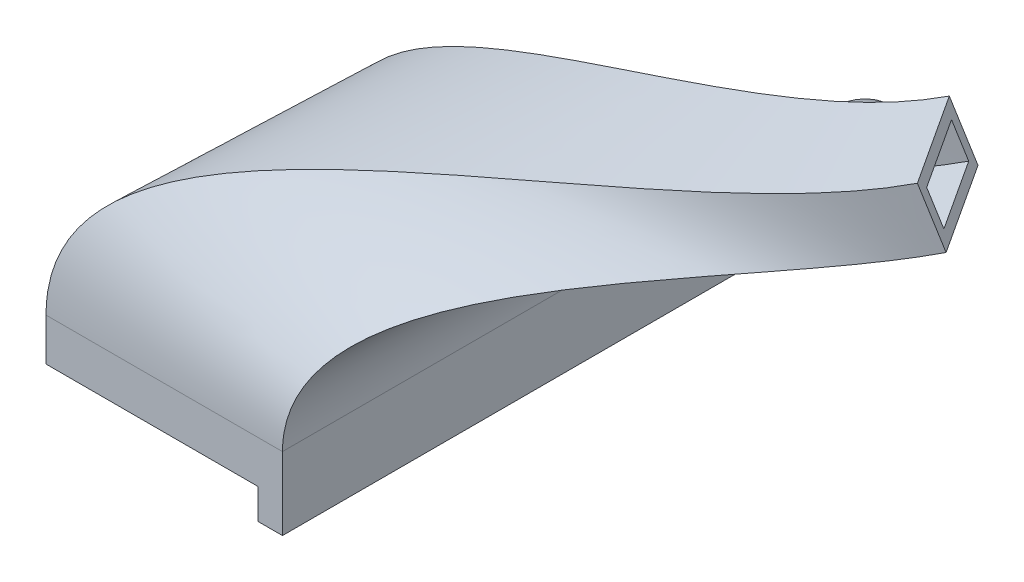
ISO-10303-21;
HEADER;
FILE_DESCRIPTION(('STEP AP214'),'2;1');
FILE_NAME('part.step','',(''),(''),'','','');
FILE_SCHEMA(('AUTOMOTIVE_DESIGN { 1 0 10303 214 1 1 1 1 }'));
ENDSEC;
DATA;
#1=APPLICATION_CONTEXT('core data for automotive mechanical design processes');
#2=APPLICATION_PROTOCOL_DEFINITION('international standard','automotive_design',2000,#1);
#3=PRODUCT_CONTEXT('',#1,'mechanical');
#4=PRODUCT('Part','Part','',(#3));
#5=PRODUCT_RELATED_PRODUCT_CATEGORY('part','',(#4));
#6=PRODUCT_DEFINITION_FORMATION('','',#4);
#7=PRODUCT_DEFINITION_CONTEXT('part definition',#1,'design');
#8=PRODUCT_DEFINITION('design','',#6,#7);
#9=PRODUCT_DEFINITION_SHAPE('','',#8);
#10=(LENGTH_UNIT() NAMED_UNIT(*) SI_UNIT(.MILLI.,.METRE.));
#11=(NAMED_UNIT(*) PLANE_ANGLE_UNIT() SI_UNIT($,.RADIAN.));
#12=(NAMED_UNIT(*) SI_UNIT($,.STERADIAN.) SOLID_ANGLE_UNIT());
#13=UNCERTAINTY_MEASURE_WITH_UNIT(LENGTH_MEASURE(1.E-05),#10,'distance_accuracy_value','');
#14=(GEOMETRIC_REPRESENTATION_CONTEXT(3) GLOBAL_UNCERTAINTY_ASSIGNED_CONTEXT((#13)) GLOBAL_UNIT_ASSIGNED_CONTEXT((#10,
#11,#12)) REPRESENTATION_CONTEXT('',''));
#15=CARTESIAN_POINT('',(0.,0.,0.));
#16=DIRECTION('',(0.,0.,1.));
#17=DIRECTION('',(1.,0.,0.));
#18=AXIS2_PLACEMENT_3D('',#15,#16,#17);
#19=CARTESIAN_POINT('',(-143.699633413346,-24.7790682036565,-0.715274363932771));
#20=DIRECTION('',(0.,-1.,0.));
#21=DIRECTION('',(0.,0.,1.));
#22=AXIS2_PLACEMENT_3D('',#19,#20,#21);
#23=PLANE('',#22);
#24=DIRECTION('',(1.,0.,0.));
#25=VECTOR('',#24,1.);
#26=CARTESIAN_POINT('',(-145.699633413346,-24.7790682036565,-0.735774363933364));
#27=LINE('',#26,#25);
#28=CARTESIAN_POINT('',(-145.699633413346,-24.7790682036565,-0.735774363933364));
#29=VERTEX_POINT('',#28);
#30=CARTESIAN_POINT('',(-143.699633413346,-24.7790682036565,-0.735774363933364));
#31=VERTEX_POINT('',#30);
#32=EDGE_CURVE('E176',#29,#31,#27,.T.);
#33=ORIENTED_EDGE('',*,*,#32,.F.);
#34=DIRECTION('',(0.,0.,1.));
#35=VECTOR('',#34,1.);
#36=CARTESIAN_POINT('',(-145.699633413346,-24.7790682036562,-27.2357743639343));
#37=LINE('',#36,#35);
#38=CARTESIAN_POINT('',(-145.699633413346,-24.779068203656,-49.1044035140349));
#39=VERTEX_POINT('',#38);
#40=EDGE_CURVE('E164',#39,#29,#37,.T.);
#41=ORIENTED_EDGE('',*,*,#40,.F.);
#42=DIRECTION('',(-1.,0.,0.));
#43=VECTOR('',#42,1.);
#44=CARTESIAN_POINT('',(-136.608464588803,-24.779068203656,-49.1044035140349));
#45=LINE('',#44,#43);
#46=CARTESIAN_POINT('',(-143.699633413346,-24.779068203656,-49.1044035140349));
#47=VERTEX_POINT('',#46);
#48=EDGE_CURVE('E174',#39,#47,#45,.F.);
#49=ORIENTED_EDGE('',*,*,#48,.T.);
#50=DIRECTION('',(0.,0.,-1.));
#51=VECTOR('',#50,1.);
#52=CARTESIAN_POINT('',(-143.699633413346,-24.7790682036565,-0.715274363932771));
#53=LINE('',#52,#51);
#54=EDGE_CURVE('E41',#31,#47,#53,.T.);
#55=ORIENTED_EDGE('',*,*,#54,.F.);
#56=EDGE_LOOP('',(#33,#41,#49,#55));
#57=FACE_BOUND('',#56,.T.);
#58=ADVANCED_FACE('F32',(#57),#23,.T.);
#59=DIRECTION('',(-1.,0.,0.));
#60=VECTOR('',#59,1.);
#61=CARTESIAN_POINT('',(-111.662615080378,-24.7790682036559,-54.9817410563492));
#62=LINE('',#61,#60);
#63=CARTESIAN_POINT('',(-143.699633413346,-24.7790682036559,-54.9817410563492));
#64=VERTEX_POINT('',#63);
#65=CARTESIAN_POINT('',(-145.699633413346,-24.7790682036559,-54.9817410563492));
#66=VERTEX_POINT('',#65);
#67=EDGE_CURVE('E195',#64,#66,#62,.T.);
#68=ORIENTED_EDGE('',*,*,#67,.F.);
#69=CARTESIAN_POINT('',(-143.699633413346,-24.779068203656,-51.3671452138318));
#70=VERTEX_POINT('',#69);
#71=EDGE_CURVE('E11',#70,#64,#53,.T.);
#72=ORIENTED_EDGE('',*,*,#71,.F.);
#73=DIRECTION('',(-1.,0.,0.));
#74=VECTOR('',#73,1.);
#75=CARTESIAN_POINT('',(-136.608464588803,-24.779068203656,-51.3671452138318));
#76=LINE('',#75,#74);
#77=CARTESIAN_POINT('',(-145.699633413346,-24.779068203656,-51.3671452138318));
#78=VERTEX_POINT('',#77);
#79=EDGE_CURVE('E187',#70,#78,#76,.T.);
#80=ORIENTED_EDGE('',*,*,#79,.T.);
#81=EDGE_CURVE('E166',#66,#78,#37,.T.);
#82=ORIENTED_EDGE('',*,*,#81,.F.);
#83=EDGE_LOOP('',(#68,#72,#80,#82));
#84=FACE_BOUND('',#83,.T.);
#85=ADVANCED_FACE('F519',(#84),#23,.T.);
#86=CARTESIAN_POINT('',(-143.699633413346,-18.7790682036565,-0.715274363932712));
#87=DIRECTION('',(1.,0.,0.));
#88=DIRECTION('',(0.,0.,1.));
#89=AXIS2_PLACEMENT_3D('',#86,#87,#88);
#90=PLANE('',#89);
#91=DIRECTION('',(0.,1.,0.));
#92=VECTOR('',#91,1.);
#93=CARTESIAN_POINT('',(-143.699633413346,-22.2790682036565,-0.73577436393334));
#94=LINE('',#93,#92);
#95=CARTESIAN_POINT('',(-143.699633413346,-18.7790682036565,-0.735774363933302));
#96=VERTEX_POINT('',#95);
#97=EDGE_CURVE('E177',#31,#96,#94,.T.);
#98=ORIENTED_EDGE('',*,*,#97,.F.);
#99=ORIENTED_EDGE('',*,*,#54,.T.);
#100=CARTESIAN_POINT('',(-143.699633413346,-26.179068203656,-50.2357743639334));
#101=DIRECTION('',(1.,0.,0.));
#102=DIRECTION('',(0.,0.,1.));
#103=AXIS2_PLACEMENT_3D('',#100,#101,#102);
#104=CIRCLE('',#103,1.79999999999998);
#105=EDGE_CURVE('E182',#47,#70,#104,.F.);
#106=ORIENTED_EDGE('',*,*,#105,.T.);
#107=ORIENTED_EDGE('',*,*,#71,.T.);
#108=CARTESIAN_POINT('',(-143.699633413346,-26.7790682036565,-47.2357743639345));
#109=DIRECTION('',(1.,0.,0.));
#110=DIRECTION('',(0.,0.,1.));
#111=AXIS2_PLACEMENT_3D('',#108,#109,#110);
#112=CIRCLE('',#111,8.);
#113=CARTESIAN_POINT('',(-143.699633413346,-18.7790682036565,-47.2357743639345));
#114=VERTEX_POINT('',#113);
#115=EDGE_CURVE('E514',#114,#64,#112,.F.);
#116=ORIENTED_EDGE('',*,*,#115,.F.);
#117=DIRECTION('',(0.,0.,1.));
#118=VECTOR('',#117,1.);
#119=CARTESIAN_POINT('',(-143.699633413346,-18.7790682036565,-20.6935123376459));
#120=LINE('',#119,#118);
#121=CARTESIAN_POINT('',(-143.699633413346,-18.7790682036565,-24.7357743639333));
#122=VERTEX_POINT('',#121);
#123=EDGE_CURVE('E183',#114,#122,#120,.T.);
#124=ORIENTED_EDGE('',*,*,#123,.T.);
#125=DIRECTION('',(0.,0.,-1.));
#126=VECTOR('',#125,1.);
#127=CARTESIAN_POINT('',(-143.699633413346,-18.7790682036565,-0.735774363933302));
#128=LINE('',#127,#126);
#129=EDGE_CURVE('E202',#96,#122,#128,.T.);
#130=ORIENTED_EDGE('',*,*,#129,.F.);
#131=EDGE_LOOP('',(#98,#99,#106,#107,#116,#124,#130));
#132=FACE_BOUND('',#131,.T.);
#133=ADVANCED_FACE('F244',(#132),#90,.T.);
#134=CARTESIAN_POINT('',(-145.699633413346,-43.5434247348692,-27.2357743639345));
#135=DIRECTION('',(-1.,0.,0.));
#136=DIRECTION('',(0.,0.,-1.));
#137=AXIS2_PLACEMENT_3D('',#134,#135,#136);
#138=PLANE('',#137);
#139=CARTESIAN_POINT('',(-145.699633413346,-26.7790682036565,-47.2357743639345));
#140=DIRECTION('',(-1.,0.,0.));
#141=DIRECTION('',(0.,0.,-1.));
#142=AXIS2_PLACEMENT_3D('',#139,#140,#141);
#143=CIRCLE('',#142,8.);
#144=CARTESIAN_POINT('',(-145.699633413346,-18.7790682036565,-47.2357743639345));
#145=VERTEX_POINT('',#144);
#146=EDGE_CURVE('E194',#145,#66,#143,.T.);
#147=ORIENTED_EDGE('',*,*,#146,.T.);
#148=ORIENTED_EDGE('',*,*,#81,.T.);
#149=CARTESIAN_POINT('',(-145.699633413346,-26.179068203656,-50.2357743639334));
#150=DIRECTION('',(-1.,0.,0.));
#151=DIRECTION('',(0.,0.,-1.));
#152=AXIS2_PLACEMENT_3D('',#149,#150,#151);
#153=CIRCLE('',#152,1.79999999999998);
#154=EDGE_CURVE('E160',#39,#78,#153,.T.);
#155=ORIENTED_EDGE('',*,*,#154,.F.);
#156=ORIENTED_EDGE('',*,*,#40,.T.);
#157=DIRECTION('',(0.,-1.,0.));
#158=VECTOR('',#157,1.);
#159=CARTESIAN_POINT('',(-145.699633413346,-43.5434247348695,-0.735774363933558));
#160=LINE('',#159,#158);
#161=CARTESIAN_POINT('',(-145.699633413346,-22.2790682036565,-0.73577436393334));
#162=VERTEX_POINT('',#161);
#163=EDGE_CURVE('E57',#162,#29,#160,.T.);
#164=ORIENTED_EDGE('',*,*,#163,.F.);
#165=DIRECTION('',(0.,0.,1.));
#166=VECTOR('',#165,1.);
#167=CARTESIAN_POINT('',(-145.699633413346,-22.2790682036565,-27.2357743639345));
#168=LINE('',#167,#166);
#169=CARTESIAN_POINT('',(-145.699633413346,-22.2790682036565,-2.23577436393334));
#170=VERTEX_POINT('',#169);
#171=EDGE_CURVE('E269',#170,#162,#168,.T.);
#172=ORIENTED_EDGE('',*,*,#171,.F.);
#173=DIRECTION('',(0.,1.,0.));
#174=VECTOR('',#173,1.);
#175=CARTESIAN_POINT('',(-145.699633413346,-22.2790682036565,-2.23577436393334));
#176=LINE('',#175,#174);
#177=CARTESIAN_POINT('',(-145.699633413346,-18.7790682036565,-2.2357743639333));
#178=VERTEX_POINT('',#177);
#179=EDGE_CURVE('E214',#170,#178,#176,.T.);
#180=ORIENTED_EDGE('',*,*,#179,.T.);
#181=DIRECTION('',(0.,0.,-1.));
#182=VECTOR('',#181,1.);
#183=CARTESIAN_POINT('',(-145.699633413346,-18.7790682036565,-27.2357743639345));
#184=LINE('',#183,#182);
#185=CARTESIAN_POINT('',(-145.699633413346,-18.7790682036565,-23.2357743639334));
#186=VERTEX_POINT('',#185);
#187=EDGE_CURVE('E278',#178,#186,#184,.T.);
#188=ORIENTED_EDGE('',*,*,#187,.T.);
#189=DIRECTION('',(0.,1.,0.));
#190=VECTOR('',#189,1.);
#191=CARTESIAN_POINT('',(-145.699633413346,-22.2790682036565,-23.2357743639334));
#192=LINE('',#191,#190);
#193=CARTESIAN_POINT('',(-145.699633413346,-22.2790682036565,-23.2357743639334));
#194=VERTEX_POINT('',#193);
#195=EDGE_CURVE('E323',#194,#186,#192,.T.);
#196=ORIENTED_EDGE('',*,*,#195,.F.);
#197=CARTESIAN_POINT('',(-145.699633413346,-22.2790682036565,-24.7357743639334));
#198=VERTEX_POINT('',#197);
#199=EDGE_CURVE('E266',#198,#194,#168,.T.);
#200=ORIENTED_EDGE('',*,*,#199,.F.);
#201=DIRECTION('',(0.,1.,0.));
#202=VECTOR('',#201,1.);
#203=CARTESIAN_POINT('',(-145.699633413346,-43.5434247348693,-24.7357743639336));
#204=LINE('',#203,#202);
#205=CARTESIAN_POINT('',(-145.699633413346,-18.7790682036565,-24.7357743639333));
#206=VERTEX_POINT('',#205);
#207=EDGE_CURVE('E255',#198,#206,#204,.T.);
#208=ORIENTED_EDGE('',*,*,#207,.T.);
#209=DIRECTION('',(0.,0.,-1.));
#210=VECTOR('',#209,1.);
#211=CARTESIAN_POINT('',(-145.699633413346,-18.7790682036565,-20.6935123376459));
#212=LINE('',#211,#210);
#213=EDGE_CURVE('E275',#206,#145,#212,.T.);
#214=ORIENTED_EDGE('',*,*,#213,.T.);
#215=EDGE_LOOP('',(#147,#148,#155,#156,#164,#172,#180,#188,#196,#200,#208,#214));
#216=FACE_BOUND('',#215,.T.);
#217=ADVANCED_FACE('F163',(#216),#138,.T.);
#218=CARTESIAN_POINT('',(-145.699633413346,-18.7790682036565,-20.6935123376459));
#219=DIRECTION('',(0.,-1.,0.));
#220=DIRECTION('',(0.,0.,1.));
#221=AXIS2_PLACEMENT_3D('',#218,#219,#220);
#222=PLANE('',#221);
#223=ORIENTED_EDGE('',*,*,#123,.F.);
#224=DIRECTION('',(1.,0.,0.));
#225=VECTOR('',#224,1.);
#226=CARTESIAN_POINT('',(-145.699633413346,-18.7790682036565,-47.2357743639345));
#227=LINE('',#226,#225);
#228=EDGE_CURVE('E192',#114,#145,#227,.F.);
#229=ORIENTED_EDGE('',*,*,#228,.T.);
#230=ORIENTED_EDGE('',*,*,#213,.F.);
#231=CARTESIAN_POINT('',(-143.699633413346,-18.7790682036565,-24.7357743639333));
#232=CARTESIAN_POINT('',(-150.199633413346,-18.7790682036565,-24.7357743639333));
#233=CARTESIAN_POINT('',(-156.699633413346,-18.7790682036565,-24.7357743639333));
#234=CARTESIAN_POINT('',(-163.199633413346,-18.7790682036565,-24.7357743639333));
#235=B_SPLINE_CURVE_WITH_KNOTS('',3,(#231,#232,#233,#234),.UNSPECIFIED.,.F.,.F.,(4,4),(0.,1.),.UNSPECIFIED.);
#236=EDGE_CURVE('E224',#206,#122,#235,.F.);
#237=ORIENTED_EDGE('',*,*,#236,.T.);
#238=EDGE_LOOP('',(#223,#229,#230,#237));
#239=FACE_BOUND('',#238,.T.);
#240=ADVANCED_FACE('F240',(#239),#222,.F.);
#241=CARTESIAN_POINT('',(-145.699633413346,-22.2790682036565,-0.73577436393334));
#242=DIRECTION('',(0.,0.,1.));
#243=DIRECTION('',(0.,1.,0.));
#244=AXIS2_PLACEMENT_3D('',#241,#242,#243);
#245=PLANE('',#244);
#246=ORIENTED_EDGE('',*,*,#32,.T.);
#247=ORIENTED_EDGE('',*,*,#97,.T.);
#248=DIRECTION('',(-1.,0.,0.));
#249=VECTOR('',#248,1.);
#250=CARTESIAN_POINT('',(-145.699633413346,-18.7790682036565,-0.735774363933302));
#251=LINE('',#250,#249);
#252=CARTESIAN_POINT('',(-145.699633413346,-18.7790682036565,-0.735774363933302));
#253=VERTEX_POINT('',#252);
#254=EDGE_CURVE('E49',#96,#253,#251,.T.);
#255=ORIENTED_EDGE('',*,*,#254,.T.);
#256=CARTESIAN_POINT('',(-163.199633413346,-18.7790682036565,-0.735774363933288));
#257=CARTESIAN_POINT('',(-156.699633413346,-18.7790682036565,-0.735774363933291));
#258=CARTESIAN_POINT('',(-150.199633413346,-18.7790682036565,-0.735774363933298));
#259=CARTESIAN_POINT('',(-143.699633413346,-18.7790682036565,-0.735774363933302));
#260=B_SPLINE_CURVE_WITH_KNOTS('',3,(#256,#257,#258,#259),.UNSPECIFIED.,.F.,.F.,(4,4),(0.,1.),.UNSPECIFIED.);
#261=CARTESIAN_POINT('',(-163.199633413346,-18.7790682036565,-0.735774363933291));
#262=VERTEX_POINT('',#261);
#263=EDGE_CURVE('E220',#262,#253,#260,.T.);
#264=ORIENTED_EDGE('',*,*,#263,.F.);
#265=DIRECTION('',(0.,1.,0.));
#266=VECTOR('',#265,1.);
#267=CARTESIAN_POINT('',(-163.199633413346,-22.2790682036565,-0.735774363933329));
#268=LINE('',#267,#266);
#269=CARTESIAN_POINT('',(-163.199633413346,-22.2790682036565,-0.735774363933329));
#270=VERTEX_POINT('',#269);
#271=EDGE_CURVE('E283',#270,#262,#268,.T.);
#272=ORIENTED_EDGE('',*,*,#271,.F.);
#273=DIRECTION('',(1.,0.,0.));
#274=VECTOR('',#273,1.);
#275=CARTESIAN_POINT('',(-145.699633413346,-22.2790682036565,-0.73577436393334));
#276=LINE('',#275,#274);
#277=EDGE_CURVE('E272',#270,#162,#276,.T.);
#278=ORIENTED_EDGE('',*,*,#277,.T.);
#279=ORIENTED_EDGE('',*,*,#163,.T.);
#280=EDGE_LOOP('',(#246,#247,#255,#264,#272,#278,#279));
#281=FACE_BOUND('',#280,.T.);
#282=ADVANCED_FACE('F230',(#281),#245,.T.);
#283=CARTESIAN_POINT('',(-111.662615080378,-26.7790682036565,-47.2357743639346));
#284=DIRECTION('',(-1.,0.,0.));
#285=DIRECTION('',(0.,0.,-1.));
#286=AXIS2_PLACEMENT_3D('',#283,#284,#285);
#287=CYLINDRICAL_SURFACE('',#286,8.);
#288=ORIENTED_EDGE('',*,*,#228,.F.);
#289=ORIENTED_EDGE('',*,*,#115,.T.);
#290=ORIENTED_EDGE('',*,*,#67,.T.);
#291=ORIENTED_EDGE('',*,*,#146,.F.);
#292=EDGE_LOOP('',(#288,#289,#290,#291));
#293=FACE_BOUND('',#292,.T.);
#294=ADVANCED_FACE('F34',(#293),#287,.T.);
#295=CARTESIAN_POINT('',(-136.608464588803,-26.179068203656,-50.2357743639334));
#296=DIRECTION('',(-1.,0.,0.));
#297=DIRECTION('',(0.,0.,-1.));
#298=AXIS2_PLACEMENT_3D('',#295,#296,#297);
#299=CYLINDRICAL_SURFACE('',#298,1.79999999999998);
#300=ORIENTED_EDGE('',*,*,#48,.F.);
#301=ORIENTED_EDGE('',*,*,#154,.T.);
#302=ORIENTED_EDGE('',*,*,#79,.F.);
#303=ORIENTED_EDGE('',*,*,#105,.F.);
#304=EDGE_LOOP('',(#300,#301,#302,#303));
#305=FACE_BOUND('',#304,.T.);
#306=ADVANCED_FACE('F180',(#305),#299,.F.);
#307=CARTESIAN_POINT('',(-163.199633413346,-22.2790682036565,-20.6935123376459));
#308=DIRECTION('',(1.,0.,0.));
#309=DIRECTION('',(0.,-1.,0.));
#310=AXIS2_PLACEMENT_3D('',#307,#308,#309);
#311=PLANE('',#310);
#312=DIRECTION('',(0.,0.,-1.));
#313=VECTOR('',#312,1.);
#314=CARTESIAN_POINT('',(-163.199633413346,-18.7790682036565,-20.6935123376459));
#315=LINE('',#314,#313);
#316=CARTESIAN_POINT('',(-163.199633413346,-18.7790682036565,-24.7357743639333));
#317=VERTEX_POINT('',#316);
#318=EDGE_CURVE('E215',#262,#317,#315,.T.);
#319=ORIENTED_EDGE('',*,*,#318,.T.);
#320=DIRECTION('',(0.,1.,0.));
#321=VECTOR('',#320,1.);
#322=CARTESIAN_POINT('',(-163.199633413346,-22.2790682036565,-24.7357743639334));
#323=LINE('',#322,#321);
#324=CARTESIAN_POINT('',(-163.199633413346,-22.2790682036565,-24.7357743639334));
#325=VERTEX_POINT('',#324);
#326=EDGE_CURVE('E279',#325,#317,#323,.T.);
#327=ORIENTED_EDGE('',*,*,#326,.F.);
#328=DIRECTION('',(0.,0.,-1.));
#329=VECTOR('',#328,1.);
#330=CARTESIAN_POINT('',(-163.199633413346,-22.2790682036565,-20.6935123376459));
#331=LINE('',#330,#329);
#332=EDGE_CURVE('E313',#270,#325,#331,.T.);
#333=ORIENTED_EDGE('',*,*,#332,.F.);
#334=ORIENTED_EDGE('',*,*,#271,.T.);
#335=EDGE_LOOP('',(#319,#327,#333,#334));
#336=FACE_BOUND('',#335,.T.);
#337=ADVANCED_FACE('F246',(#336),#311,.F.);
#338=CARTESIAN_POINT('',(-145.699633413346,-22.2790682036565,-24.7357743639334));
#339=DIRECTION('',(0.,0.,1.));
#340=DIRECTION('',(0.,1.,0.));
#341=AXIS2_PLACEMENT_3D('',#338,#339,#340);
#342=PLANE('',#341);
#343=ORIENTED_EDGE('',*,*,#207,.F.);
#344=DIRECTION('',(1.,0.,0.));
#345=VECTOR('',#344,1.);
#346=CARTESIAN_POINT('',(-145.699633413346,-22.2790682036565,-24.7357743639334));
#347=LINE('',#346,#345);
#348=EDGE_CURVE('E315',#325,#198,#347,.T.);
#349=ORIENTED_EDGE('',*,*,#348,.F.);
#350=ORIENTED_EDGE('',*,*,#326,.T.);
#351=DIRECTION('',(-1.,0.,0.));
#352=VECTOR('',#351,1.);
#353=CARTESIAN_POINT('',(-145.699633413346,-18.7790682036565,-24.7357743639334));
#354=LINE('',#353,#352);
#355=EDGE_CURVE('E211',#317,#206,#354,.F.);
#356=ORIENTED_EDGE('',*,*,#355,.T.);
#357=EDGE_LOOP('',(#343,#349,#350,#356));
#358=FACE_BOUND('',#357,.T.);
#359=ADVANCED_FACE('F295',(#358),#342,.F.);
#360=CARTESIAN_POINT('',(-141.699633413346,-22.2790682036565,-27.2357743639346));
#361=DIRECTION('',(0.,-1.,0.));
#362=DIRECTION('',(0.,0.,1.));
#363=AXIS2_PLACEMENT_3D('',#360,#361,#362);
#364=PLANE('',#363);
#365=ORIENTED_EDGE('',*,*,#348,.T.);
#366=ORIENTED_EDGE('',*,*,#199,.T.);
#367=DIRECTION('',(1.,0.,0.));
#368=VECTOR('',#367,1.);
#369=CARTESIAN_POINT('',(-145.699633413346,-22.2790682036565,-23.2357743639334));
#370=LINE('',#369,#368);
#371=CARTESIAN_POINT('',(-161.699633413346,-22.2790682036565,-23.2357743639334));
#372=VERTEX_POINT('',#371);
#373=EDGE_CURVE('E326',#372,#194,#370,.T.);
#374=ORIENTED_EDGE('',*,*,#373,.F.);
#375=DIRECTION('',(0.,0.,-1.));
#376=VECTOR('',#375,1.);
#377=CARTESIAN_POINT('',(-161.699633413346,-22.2790682036565,-20.6935123376459));
#378=LINE('',#377,#376);
#379=CARTESIAN_POINT('',(-161.699633413346,-22.2790682036565,-2.23577436393333));
#380=VERTEX_POINT('',#379);
#381=EDGE_CURVE('E322',#380,#372,#378,.T.);
#382=ORIENTED_EDGE('',*,*,#381,.F.);
#383=DIRECTION('',(1.,0.,0.));
#384=VECTOR('',#383,1.);
#385=CARTESIAN_POINT('',(-145.699633413346,-22.2790682036565,-2.23577436393334));
#386=LINE('',#385,#384);
#387=EDGE_CURVE('E319',#380,#170,#386,.T.);
#388=ORIENTED_EDGE('',*,*,#387,.T.);
#389=ORIENTED_EDGE('',*,*,#171,.T.);
#390=ORIENTED_EDGE('',*,*,#277,.F.);
#391=ORIENTED_EDGE('',*,*,#332,.T.);
#392=EDGE_LOOP('',(#365,#366,#374,#382,#388,#389,#390,#391));
#393=FACE_BOUND('',#392,.T.);
#394=ADVANCED_FACE('F582',(#393),#364,.T.);
#395=CARTESIAN_POINT('',(-145.699633413346,-22.2790682036565,-2.23577436393334));
#396=DIRECTION('',(0.,0.,1.));
#397=DIRECTION('',(0.,1.,0.));
#398=AXIS2_PLACEMENT_3D('',#395,#396,#397);
#399=PLANE('',#398);
#400=DIRECTION('',(-1.,0.,0.));
#401=VECTOR('',#400,1.);
#402=CARTESIAN_POINT('',(-145.699633413346,-18.7790682036565,-2.2357743639333));
#403=LINE('',#402,#401);
#404=CARTESIAN_POINT('',(-161.699633413346,-18.7790682036565,-2.23577436393329));
#405=VERTEX_POINT('',#404);
#406=EDGE_CURVE('E328',#405,#178,#403,.F.);
#407=ORIENTED_EDGE('',*,*,#406,.T.);
#408=ORIENTED_EDGE('',*,*,#179,.F.);
#409=ORIENTED_EDGE('',*,*,#387,.F.);
#410=DIRECTION('',(0.,1.,0.));
#411=VECTOR('',#410,1.);
#412=CARTESIAN_POINT('',(-161.699633413346,-22.2790682036565,-2.23577436393333));
#413=LINE('',#412,#411);
#414=EDGE_CURVE('E554',#380,#405,#413,.T.);
#415=ORIENTED_EDGE('',*,*,#414,.T.);
#416=EDGE_LOOP('',(#407,#408,#409,#415));
#417=FACE_BOUND('',#416,.T.);
#418=ADVANCED_FACE('F424',(#417),#399,.F.);
#419=CARTESIAN_POINT('',(-161.699633413346,-22.2790682036565,-20.6935123376459));
#420=DIRECTION('',(1.,0.,0.));
#421=DIRECTION('',(0.,-1.,0.));
#422=AXIS2_PLACEMENT_3D('',#419,#420,#421);
#423=PLANE('',#422);
#424=DIRECTION('',(0.,0.,-1.));
#425=VECTOR('',#424,1.);
#426=CARTESIAN_POINT('',(-161.699633413346,-18.7790682036565,-20.6935123376459));
#427=LINE('',#426,#425);
#428=CARTESIAN_POINT('',(-161.699633413346,-18.7790682036565,-23.2357743639333));
#429=VERTEX_POINT('',#428);
#430=EDGE_CURVE('E525',#405,#429,#427,.T.);
#431=ORIENTED_EDGE('',*,*,#430,.F.);
#432=ORIENTED_EDGE('',*,*,#414,.F.);
#433=ORIENTED_EDGE('',*,*,#381,.T.);
#434=DIRECTION('',(0.,1.,0.));
#435=VECTOR('',#434,1.);
#436=CARTESIAN_POINT('',(-161.699633413346,-22.2790682036565,-23.2357743639334));
#437=LINE('',#436,#435);
#438=EDGE_CURVE('E207',#372,#429,#437,.T.);
#439=ORIENTED_EDGE('',*,*,#438,.T.);
#440=EDGE_LOOP('',(#431,#432,#433,#439));
#441=FACE_BOUND('',#440,.T.);
#442=ADVANCED_FACE('F564',(#441),#423,.T.);
#443=CARTESIAN_POINT('',(-145.699633413346,-22.2790682036565,-23.2357743639334));
#444=DIRECTION('',(0.,0.,1.));
#445=DIRECTION('',(0.,1.,0.));
#446=AXIS2_PLACEMENT_3D('',#443,#444,#445);
#447=PLANE('',#446);
#448=DIRECTION('',(-1.,0.,0.));
#449=VECTOR('',#448,1.);
#450=CARTESIAN_POINT('',(-145.699633413346,-18.7790682036565,-23.2357743639334));
#451=LINE('',#450,#449);
#452=EDGE_CURVE('E206',#429,#186,#451,.F.);
#453=ORIENTED_EDGE('',*,*,#452,.F.);
#454=ORIENTED_EDGE('',*,*,#438,.F.);
#455=ORIENTED_EDGE('',*,*,#373,.T.);
#456=ORIENTED_EDGE('',*,*,#195,.T.);
#457=EDGE_LOOP('',(#453,#454,#455,#456));
#458=FACE_BOUND('',#457,.T.);
#459=ADVANCED_FACE('F422',(#458),#447,.T.);
#460=CARTESIAN_POINT('',(-115.413195673234,-3.63822012652591,-27.1767708600997));
#461=CARTESIAN_POINT('',(-126.326531656881,-8.37806780461845,-20.0712908817947));
#462=CARTESIAN_POINT('',(-143.699633413346,-4.92068070634676,-0.735774363933302));
#463=CARTESIAN_POINT('',(-143.699633413346,-18.7790682036565,-0.735774363933302));
#464=CARTESIAN_POINT('',(-115.890900294997,-2.07206575854939,-26.865745832503));
#465=CARTESIAN_POINT('',(-128.110632399916,-7.37930352078785,-18.9096944526272));
#466=CARTESIAN_POINT('',(-150.199633413346,-3.26174308171199,-0.735774363933298));
#467=CARTESIAN_POINT('',(-150.199633413346,-18.7790682036565,-0.735774363933298));
#468=CARTESIAN_POINT('',(-116.368604916761,-0.505911390572877,-26.5547208049064));
#469=CARTESIAN_POINT('',(-129.89473314295,-6.38053923695728,-17.7480980234596));
#470=CARTESIAN_POINT('',(-156.699633413346,-1.60280545707721,-0.735774363933291));
#471=CARTESIAN_POINT('',(-156.699633413346,-18.7790682036565,-0.735774363933291));
#472=CARTESIAN_POINT('',(-116.846309538525,1.06024297740365,-26.2436957773097));
#473=CARTESIAN_POINT('',(-131.678833885985,-5.38177495312669,-16.5865015942921));
#474=CARTESIAN_POINT('',(-163.199633413346,0.0561321675575654,-0.735774363933288));
#475=CARTESIAN_POINT('',(-163.199633413346,-18.7790682036565,-0.735774363933288));
#476=B_SPLINE_SURFACE_WITH_KNOTS('',3,3,((#460,#461,#462,#463),(#464,#465,#466,#467),(#468,#469,
#470,#471),(#472,#473,#474,#475)),.UNSPECIFIED.,.F.,.F.,.F.,(4,4),(4,4),(0.,1.),(0.,1.),.UNSPECIFIED.);
#477=DIRECTION('',(0.286622773058202,-0.939692620785908,-0.186615016557989));
#478=VECTOR('',#477,1.);
#479=CARTESIAN_POINT('',(-116.846309538525,1.06024297740364,-26.2436957773097));
#480=LINE('',#479,#478);
#481=CARTESIAN_POINT('',(-116.846309538525,1.06024297740364,-26.2436957773097));
#482=VERTEX_POINT('',#481);
#483=CARTESIAN_POINT('',(-115.413195673234,-3.63822012652591,-27.1767708600997));
#484=VERTEX_POINT('',#483);
#485=EDGE_CURVE('E450',#482,#484,#480,.T.);
#486=CARTESIAN_POINT('',(-116.846309538525,1.06024297740365,-26.2436957773097));
#487=CARTESIAN_POINT('',(-131.678833885985,-5.38177495312669,-16.5865015942921));
#488=CARTESIAN_POINT('',(-163.199633413346,0.0561321675575654,-0.735774363933288));
#489=CARTESIAN_POINT('',(-163.199633413346,-18.7790682036565,-0.735774363933288));
#490=B_SPLINE_CURVE_WITH_KNOTS('',3,(#486,#487,#488,#489),.UNSPECIFIED.,.F.,.F.,(4,4),(0.,1.),.UNSPECIFIED.);
#491=EDGE_CURVE('E205',#482,#262,#490,.T.);
#492=CARTESIAN_POINT('',(-115.413195673234,-3.63822012652591,-27.1767708600997));
#493=CARTESIAN_POINT('',(-126.326531656881,-8.37806780461845,-20.0712908817947));
#494=CARTESIAN_POINT('',(-143.699633413346,-4.92068070634676,-0.735774363933302));
#495=CARTESIAN_POINT('',(-143.699633413346,-18.7790682036565,-0.735774363933302));
#496=B_SPLINE_CURVE_WITH_KNOTS('',3,(#492,#493,#494,#495),.UNSPECIFIED.,.F.,.F.,(4,4),(0.,1.),.UNSPECIFIED.);
#497=EDGE_CURVE('E398',#484,#96,#496,.T.);
#498=ORIENTED_EDGE('',*,*,#485,.F.);
#499=ORIENTED_EDGE('',*,*,#491,.T.);
#500=ORIENTED_EDGE('',*,*,#263,.T.);
#501=ORIENTED_EDGE('',*,*,#254,.F.);
#502=ORIENTED_EDGE('',*,*,#497,.F.);
#503=EDGE_LOOP('',(#498,#499,#500,#501,#502));
#504=FACE_BOUND('',#503,.T.);
#505=ADVANCED_FACE('F411',(#504),#476,.T.);
#506=CARTESIAN_POINT('',(-116.846309538525,1.06024297740365,-26.2436957773097));
#507=CARTESIAN_POINT('',(-131.678833885985,-5.38177495312669,-16.5865015942921));
#508=CARTESIAN_POINT('',(-163.199633413346,0.0561321675575654,-0.735774363933288));
#509=CARTESIAN_POINT('',(-163.199633413346,-18.7790682036565,-0.735774363933288));
#510=CARTESIAN_POINT('',(-118.483186958171,1.06024297740365,-28.7577825524733));
#511=CARTESIAN_POINT('',(-132.469062405678,-5.01406091695877,-19.6518264891549));
#512=CARTESIAN_POINT('',(-163.199633413346,-1.01899174939196,-8.73577436393331));
#513=CARTESIAN_POINT('',(-163.199633413346,-18.7790682036565,-8.73577436393331));
#514=CARTESIAN_POINT('',(-120.120064377817,1.06024297740365,-31.2718693276368));
#515=CARTESIAN_POINT('',(-133.25929092537,-4.64634688079084,-22.7171513840178));
#516=CARTESIAN_POINT('',(-163.199633413346,-2.09411566634148,-16.7357743639333));
#517=CARTESIAN_POINT('',(-163.199633413346,-18.7790682036565,-16.7357743639333));
#518=CARTESIAN_POINT('',(-121.756941797463,1.06024297740365,-33.7859561028003));
#519=CARTESIAN_POINT('',(-134.049519445063,-4.2786328446229,-25.7824762788807));
#520=CARTESIAN_POINT('',(-163.199633413346,-3.169239583291,-24.7357743639333));
#521=CARTESIAN_POINT('',(-163.199633413346,-18.7790682036565,-24.7357743639333));
#522=B_SPLINE_SURFACE_WITH_KNOTS('',3,3,((#506,#507,#508,#509),(#510,#511,#512,#513),(#514,#515,
#516,#517),(#518,#519,#520,#521)),.UNSPECIFIED.,.F.,.F.,.F.,(4,4),(4,4),(0.,1.),(0.,1.),.UNSPECIFIED.);
#523=DIRECTION('',(-0.545625806548753,0.,-0.838028925054513));
#524=VECTOR('',#523,1.);
#525=CARTESIAN_POINT('',(-116.846309538525,1.06024297740364,-26.2436957773097));
#526=LINE('',#525,#524);
#527=CARTESIAN_POINT('',(-121.756941797463,1.06024297740365,-33.7859561028003));
#528=VERTEX_POINT('',#527);
#529=EDGE_CURVE('E308',#482,#528,#526,.T.);
#530=CARTESIAN_POINT('',(-121.756941797463,1.06024297740365,-33.7859561028003));
#531=CARTESIAN_POINT('',(-134.049519445063,-4.2786328446229,-25.7824762788807));
#532=CARTESIAN_POINT('',(-163.199633413346,-3.169239583291,-24.7357743639333));
#533=CARTESIAN_POINT('',(-163.199633413346,-18.7790682036565,-24.7357743639333));
#534=B_SPLINE_CURVE_WITH_KNOTS('',3,(#530,#531,#532,#533),.UNSPECIFIED.,.F.,.F.,(4,4),(0.,1.),.UNSPECIFIED.);
#535=EDGE_CURVE('E300',#317,#528,#534,.F.);
#536=ORIENTED_EDGE('',*,*,#529,.T.);
#537=ORIENTED_EDGE('',*,*,#535,.F.);
#538=ORIENTED_EDGE('',*,*,#318,.F.);
#539=ORIENTED_EDGE('',*,*,#491,.F.);
#540=EDGE_LOOP('',(#536,#537,#538,#539));
#541=FACE_BOUND('',#540,.T.);
#542=ADVANCED_FACE('F306',(#541),#522,.T.);
#543=CARTESIAN_POINT('',(-120.323827932172,-3.63822012652589,-34.7190311855903));
#544=CARTESIAN_POINT('',(-128.09008397662,-7.01123739044072,-29.6625592770101));
#545=CARTESIAN_POINT('',(-143.699633413346,-8.91702548559628,-24.7357743639333));
#546=CARTESIAN_POINT('',(-143.699633413346,-18.7790682036565,-24.7357743639333));
#547=CARTESIAN_POINT('',(-118.686950512526,-3.6382201265259,-32.2049444104267));
#548=CARTESIAN_POINT('',(-127.502233203374,-7.46684752849998,-26.4654698119383));
#549=CARTESIAN_POINT('',(-143.699633413346,-7.58491055917977,-16.7357743639333));
#550=CARTESIAN_POINT('',(-143.699633413346,-18.7790682036565,-16.7357743639333));
#551=CARTESIAN_POINT('',(-117.05007309288,-3.6382201265259,-29.6908576352632));
#552=CARTESIAN_POINT('',(-126.914382430127,-7.92245766655921,-23.2683803468665));
#553=CARTESIAN_POINT('',(-143.699633413346,-6.25279563276327,-8.73577436393332));
#554=CARTESIAN_POINT('',(-143.699633413346,-18.7790682036565,-8.73577436393332));
#555=CARTESIAN_POINT('',(-115.413195673234,-3.63822012652591,-27.1767708600997));
#556=CARTESIAN_POINT('',(-126.326531656881,-8.37806780461845,-20.0712908817947));
#557=CARTESIAN_POINT('',(-143.699633413346,-4.92068070634676,-0.735774363933302));
#558=CARTESIAN_POINT('',(-143.699633413346,-18.7790682036565,-0.735774363933302));
#559=B_SPLINE_SURFACE_WITH_KNOTS('',3,3,((#543,#544,#545,#546),(#547,#548,#549,#550),(#551,#552,
#553,#554),(#555,#556,#557,#558)),.UNSPECIFIED.,.F.,.F.,.F.,(4,4),(4,4),(0.,1.),(0.,1.),.UNSPECIFIED.);
#560=DIRECTION('',(-0.545625806548753,0.,-0.838028925054513));
#561=VECTOR('',#560,1.);
#562=CARTESIAN_POINT('',(-115.413195673234,-3.63822012652591,-27.1767708600997));
#563=LINE('',#562,#561);
#564=CARTESIAN_POINT('',(-120.323827932172,-3.63822012652589,-34.7190311855903));
#565=VERTEX_POINT('',#564);
#566=EDGE_CURVE('E454',#484,#565,#563,.T.);
#567=CARTESIAN_POINT('',(-120.323827932172,-3.63822012652589,-34.7190311855903));
#568=CARTESIAN_POINT('',(-128.09008397662,-7.01123739044072,-29.6625592770101));
#569=CARTESIAN_POINT('',(-143.699633413346,-8.91702548559628,-24.7357743639333));
#570=CARTESIAN_POINT('',(-143.699633413346,-18.7790682036565,-24.7357743639333));
#571=B_SPLINE_CURVE_WITH_KNOTS('',3,(#567,#568,#569,#570),.UNSPECIFIED.,.F.,.F.,(4,4),(0.,1.),.UNSPECIFIED.);
#572=EDGE_CURVE('E311',#565,#122,#571,.T.);
#573=ORIENTED_EDGE('',*,*,#566,.F.);
#574=ORIENTED_EDGE('',*,*,#497,.T.);
#575=ORIENTED_EDGE('',*,*,#129,.T.);
#576=ORIENTED_EDGE('',*,*,#572,.F.);
#577=EDGE_LOOP('',(#573,#574,#575,#576));
#578=FACE_BOUND('',#577,.T.);
#579=ADVANCED_FACE('F356',(#578),#559,.T.);
#580=CARTESIAN_POINT('',(-121.756941797463,1.06024297740365,-33.7859561028003));
#581=CARTESIAN_POINT('',(-134.049519445063,-4.2786328446229,-25.7824762788807));
#582=CARTESIAN_POINT('',(-163.199633413346,-3.169239583291,-24.7357743639333));
#583=CARTESIAN_POINT('',(-163.199633413346,-18.7790682036565,-24.7357743639333));
#584=CARTESIAN_POINT('',(-121.2792371757,-0.505911390572863,-34.096981130397));
#585=CARTESIAN_POINT('',(-132.063040955582,-5.18950102656218,-27.0758372782571));
#586=CARTESIAN_POINT('',(-156.699633413346,-5.08516821739276,-24.7357743639333));
#587=CARTESIAN_POINT('',(-156.699633413346,-18.7790682036565,-24.7357743639333));
#588=CARTESIAN_POINT('',(-120.801532553936,-2.07206575854937,-34.4080061579936));
#589=CARTESIAN_POINT('',(-130.076562466101,-6.10036920850145,-28.3691982776336));
#590=CARTESIAN_POINT('',(-150.199633413346,-7.00109685149452,-24.7357743639333));
#591=CARTESIAN_POINT('',(-150.199633413346,-18.7790682036565,-24.7357743639333));
#592=CARTESIAN_POINT('',(-120.323827932172,-3.63822012652589,-34.7190311855903));
#593=CARTESIAN_POINT('',(-128.09008397662,-7.01123739044072,-29.6625592770101));
#594=CARTESIAN_POINT('',(-143.699633413346,-8.91702548559628,-24.7357743639333));
#595=CARTESIAN_POINT('',(-143.699633413346,-18.7790682036565,-24.7357743639333));
#596=B_SPLINE_SURFACE_WITH_KNOTS('',3,3,((#580,#581,#582,#583),(#584,#585,#586,#587),(#588,#589,
#590,#591),(#592,#593,#594,#595)),.UNSPECIFIED.,.F.,.F.,.F.,(4,4),(4,4),(0.,1.),(0.,1.),.UNSPECIFIED.);
#597=DIRECTION('',(0.286622773058202,-0.939692620785908,-0.186615016557989));
#598=VECTOR('',#597,1.);
#599=CARTESIAN_POINT('',(-121.756941797463,1.06024297740365,-33.7859561028003));
#600=LINE('',#599,#598);
#601=EDGE_CURVE('E381',#528,#565,#600,.T.);
#602=ORIENTED_EDGE('',*,*,#601,.T.);
#603=ORIENTED_EDGE('',*,*,#572,.T.);
#604=ORIENTED_EDGE('',*,*,#236,.F.);
#605=ORIENTED_EDGE('',*,*,#355,.F.);
#606=ORIENTED_EDGE('',*,*,#535,.T.);
#607=EDGE_LOOP('',(#602,#603,#604,#605,#606));
#608=FACE_BOUND('',#607,.T.);
#609=ADVANCED_FACE('F299',(#608),#596,.T.);
#610=CARTESIAN_POINT('',(-114.674228578716,-31.8058311569872,-44.8315373135754));
#611=DIRECTION('',(0.787489596878873,0.34202014332567,-0.512720544124222));
#612=DIRECTION('',(0.545625806548753,0.,0.838028925054513));
#613=AXIS2_PLACEMENT_3D('',#610,#611,#612);
#614=PLANE('',#613);
#615=DIRECTION('',(0.286622773058202,-0.939692620785907,-0.186615016557992));
#616=VECTOR('',#615,1.);
#617=CARTESIAN_POINT('',(-117.105312572015,0.120550356617725,-27.2683397189222));
#618=LINE('',#617,#616);
#619=CARTESIAN_POINT('',(-117.105312572015,0.120550356617725,-27.2683397189222));
#620=VERTEX_POINT('',#619);
#621=CARTESIAN_POINT('',(-116.24544425284,-2.69852750573999,-27.8281847685962));
#622=VERTEX_POINT('',#621);
#623=EDGE_CURVE('E536',#620,#622,#618,.T.);
#624=ORIENTED_EDGE('',*,*,#623,.F.);
#625=DIRECTION('',(-0.545625806548753,0.,-0.838028925054513));
#626=VECTOR('',#625,1.);
#627=CARTESIAN_POINT('',(-117.105312572015,0.120550356617725,-27.2683397189222));
#628=LINE('',#627,#626);
#629=CARTESIAN_POINT('',(-120.924693217856,0.120550356617698,-33.1345421943038));
#630=VERTEX_POINT('',#629);
#631=EDGE_CURVE('E453',#620,#630,#628,.T.);
#632=ORIENTED_EDGE('',*,*,#631,.T.);
#633=DIRECTION('',(0.286622773058201,-0.939692620785908,-0.186615016557992));
#634=VECTOR('',#633,1.);
#635=CARTESIAN_POINT('',(-120.924693217856,0.120550356617739,-33.1345421943038));
#636=LINE('',#635,#634);
#637=CARTESIAN_POINT('',(-120.064824898682,-2.69852750573998,-33.6943872439778));
#638=VERTEX_POINT('',#637);
#639=EDGE_CURVE('E545',#630,#638,#636,.T.);
#640=ORIENTED_EDGE('',*,*,#639,.T.);
#641=DIRECTION('',(-0.545625806548753,0.,-0.838028925054513));
#642=VECTOR('',#641,1.);
#643=CARTESIAN_POINT('',(-116.24544425284,-2.69852750573999,-27.8281847685962));
#644=LINE('',#643,#642);
#645=EDGE_CURVE('E540',#622,#638,#644,.T.);
#646=ORIENTED_EDGE('',*,*,#645,.F.);
#647=EDGE_LOOP('',(#624,#632,#640,#646));
#648=FACE_BOUND('',#647,.T.);
#649=ORIENTED_EDGE('',*,*,#485,.T.);
#650=ORIENTED_EDGE('',*,*,#566,.T.);
#651=ORIENTED_EDGE('',*,*,#601,.F.);
#652=ORIENTED_EDGE('',*,*,#529,.F.);
#653=EDGE_LOOP('',(#649,#650,#651,#652));
#654=FACE_BOUND('',#653,.T.);
#655=ADVANCED_FACE('F355',(#648,#654),#614,.T.);
#656=CARTESIAN_POINT('',(-145.699633413346,-18.7790682036565,-2.2357743639333));
#657=CARTESIAN_POINT('',(-145.699633413346,-4.71135687372355,-2.2357743639333));
#658=CARTESIAN_POINT('',(-127.323620577058,-7.5099681510678,-20.6153801609305));
#659=CARTESIAN_POINT('',(-116.24544425284,-2.69852750573999,-27.8281847685962));
#660=CARTESIAN_POINT('',(-145.699633413346,-18.7790682036565,-9.23577436393332));
#661=CARTESIAN_POINT('',(-145.699633413346,-5.84311224833341,-9.23577436393332));
#662=CARTESIAN_POINT('',(-127.705501875288,-7.12288501563414,-23.1510552175432));
#663=CARTESIAN_POINT('',(-117.518571134788,-2.69852750573999,-29.7835855937234));
#664=CARTESIAN_POINT('',(-145.699633413346,-18.7790682036565,-16.2357743639333));
#665=CARTESIAN_POINT('',(-145.699633413346,-6.97486762294327,-16.2357743639333));
#666=CARTESIAN_POINT('',(-128.087383173518,-6.73580188020048,-25.6867302741558));
#667=CARTESIAN_POINT('',(-118.791698016735,-2.69852750573998,-31.7389864188506));
#668=CARTESIAN_POINT('',(-145.699633413346,-18.7790682036565,-23.2357743639334));
#669=CARTESIAN_POINT('',(-145.699633413346,-8.10662299755315,-23.2357743639334));
#670=CARTESIAN_POINT('',(-128.469264471748,-6.34871874476681,-28.2224053307685));
#671=CARTESIAN_POINT('',(-120.064824898682,-2.69852750573998,-33.6943872439778));
#672=B_SPLINE_SURFACE_WITH_KNOTS('',3,3,((#656,#657,#658,#659),(#660,#661,#662,#663),(#664,#665,
#666,#667),(#668,#669,#670,#671)),.UNSPECIFIED.,.F.,.F.,.F.,(4,4),(4,4),(0.,1.),(0.,1.),.UNSPECIFIED.);
#673=CARTESIAN_POINT('',(-145.699633413346,-18.7790682036565,-2.2357743639333));
#674=CARTESIAN_POINT('',(-145.699633413346,-4.71135687372355,-2.2357743639333));
#675=CARTESIAN_POINT('',(-127.323620577058,-7.5099681510678,-20.6153801609305));
#676=CARTESIAN_POINT('',(-116.24544425284,-2.69852750573999,-27.8281847685962));
#677=B_SPLINE_CURVE_WITH_KNOTS('',3,(#673,#674,#675,#676),.UNSPECIFIED.,.F.,.F.,(4,4),(0.,1.),.UNSPECIFIED.);
#678=EDGE_CURVE('E197',#622,#178,#677,.F.);
#679=CARTESIAN_POINT('',(-145.699633413346,-18.7790682036565,-23.2357743639334));
#680=CARTESIAN_POINT('',(-145.699633413346,-8.10662299755315,-23.2357743639334));
#681=CARTESIAN_POINT('',(-128.469264471748,-6.34871874476681,-28.2224053307685));
#682=CARTESIAN_POINT('',(-120.064824898682,-2.69852750573998,-33.6943872439778));
#683=B_SPLINE_CURVE_WITH_KNOTS('',3,(#679,#680,#681,#682),.UNSPECIFIED.,.F.,.F.,(4,4),(0.,1.),.UNSPECIFIED.);
#684=EDGE_CURVE('E569',#186,#638,#683,.T.);
#685=ORIENTED_EDGE('',*,*,#187,.F.);
#686=ORIENTED_EDGE('',*,*,#678,.F.);
#687=ORIENTED_EDGE('',*,*,#645,.T.);
#688=ORIENTED_EDGE('',*,*,#684,.F.);
#689=EDGE_LOOP('',(#685,#686,#687,#688));
#690=FACE_BOUND('',#689,.T.);
#691=ADVANCED_FACE('F625',(#690),#672,.F.);
#692=CARTESIAN_POINT('',(-145.699633413346,-18.7790682036565,-23.2357743639334));
#693=CARTESIAN_POINT('',(-145.699633413346,-8.10662299755315,-23.2357743639334));
#694=CARTESIAN_POINT('',(-128.469264471748,-6.34871874476681,-28.2224053307685));
#695=CARTESIAN_POINT('',(-120.064824898682,-2.69852750573998,-33.6943872439778));
#696=CARTESIAN_POINT('',(-151.03296674668,-18.7790682036565,-23.2357743639333));
#697=CARTESIAN_POINT('',(-151.03296674668,-6.55084801633184,-23.2357743639333));
#698=CARTESIAN_POINT('',(-129.981043857602,-5.9411325060407,-27.2381125193039));
#699=CARTESIAN_POINT('',(-120.35144767174,-1.75883488495407,-33.5077722274198));
#700=CARTESIAN_POINT('',(-156.366300080013,-18.7790682036565,-23.2357743639333));
#701=CARTESIAN_POINT('',(-156.366300080013,-4.99507303511054,-23.2357743639333));
#702=CARTESIAN_POINT('',(-131.492823243457,-5.5335462673146,-26.2538197078392));
#703=CARTESIAN_POINT('',(-120.638070444798,-0.819142264168168,-33.3211572108618));
#704=CARTESIAN_POINT('',(-161.699633413346,-18.7790682036565,-23.2357743639333));
#705=CARTESIAN_POINT('',(-161.699633413346,-3.43929805388923,-23.2357743639333));
#706=CARTESIAN_POINT('',(-133.004602629311,-5.12596002858849,-25.2695268963746));
#707=CARTESIAN_POINT('',(-120.924693217856,0.120550356617739,-33.1345421943038));
#708=B_SPLINE_SURFACE_WITH_KNOTS('',3,3,((#692,#693,#694,#695),(#696,#697,#698,#699),(#700,#701,
#702,#703),(#704,#705,#706,#707)),.UNSPECIFIED.,.F.,.F.,.F.,(4,4),(4,4),(0.,1.),(0.,1.),.UNSPECIFIED.);
#709=CARTESIAN_POINT('',(-161.699633413346,-18.7790682036565,-23.2357743639333));
#710=CARTESIAN_POINT('',(-161.699633413346,-3.43929805388923,-23.2357743639333));
#711=CARTESIAN_POINT('',(-133.004602629311,-5.12596002858849,-25.2695268963746));
#712=CARTESIAN_POINT('',(-120.924693217856,0.120550356617739,-33.1345421943038));
#713=B_SPLINE_CURVE_WITH_KNOTS('',3,(#709,#710,#711,#712),.UNSPECIFIED.,.F.,.F.,(4,4),(0.,1.),.UNSPECIFIED.);
#714=EDGE_CURVE('E571',#429,#630,#713,.T.);
#715=ORIENTED_EDGE('',*,*,#452,.T.);
#716=ORIENTED_EDGE('',*,*,#684,.T.);
#717=ORIENTED_EDGE('',*,*,#639,.F.);
#718=ORIENTED_EDGE('',*,*,#714,.F.);
#719=EDGE_LOOP('',(#715,#716,#717,#718));
#720=FACE_BOUND('',#719,.T.);
#721=ADVANCED_FACE('F568',(#720),#708,.F.);
#722=CARTESIAN_POINT('',(-161.699633413346,-18.7790682036565,-2.23577436393329));
#723=CARTESIAN_POINT('',(-161.699633413346,-0.605588254152425,-2.23577436393329));
#724=CARTESIAN_POINT('',(-131.416738971336,-6.09514586043784,-17.9504231905818));
#725=CARTESIAN_POINT('',(-117.105312572015,0.120550356617732,-27.2683397189222));
#726=CARTESIAN_POINT('',(-156.366300080013,-18.7790682036565,-2.23577436393329));
#727=CARTESIAN_POINT('',(-156.366300080013,-1.97417779400947,-2.23577436393329));
#728=CARTESIAN_POINT('',(-130.052366173243,-6.56675329064783,-18.8387421806981));
#729=CARTESIAN_POINT('',(-116.818689798957,-0.819142264168182,-27.4549547354802));
#730=CARTESIAN_POINT('',(-151.03296674668,-18.7790682036565,-2.2357743639333));
#731=CARTESIAN_POINT('',(-151.03296674668,-3.34276733386651,-2.2357743639333));
#732=CARTESIAN_POINT('',(-128.687993375151,-7.03836072085781,-19.7270611708143));
#733=CARTESIAN_POINT('',(-116.532067025899,-1.75883488495408,-27.6415697520382));
#734=CARTESIAN_POINT('',(-145.699633413346,-18.7790682036565,-2.2357743639333));
#735=CARTESIAN_POINT('',(-145.699633413346,-4.71135687372355,-2.2357743639333));
#736=CARTESIAN_POINT('',(-127.323620577058,-7.5099681510678,-20.6153801609305));
#737=CARTESIAN_POINT('',(-116.24544425284,-2.69852750573999,-27.8281847685962));
#738=B_SPLINE_SURFACE_WITH_KNOTS('',3,3,((#722,#723,#724,#725),(#726,#727,#728,#729),(#730,#731,
#732,#733),(#734,#735,#736,#737)),.UNSPECIFIED.,.F.,.F.,.F.,(4,4),(4,4),(0.,1.),(0.,1.),.UNSPECIFIED.);
#739=CARTESIAN_POINT('',(-161.699633413346,-18.7790682036565,-2.23577436393329));
#740=CARTESIAN_POINT('',(-161.699633413346,-0.605588254152425,-2.23577436393329));
#741=CARTESIAN_POINT('',(-131.416738971336,-6.09514586043784,-17.9504231905818));
#742=CARTESIAN_POINT('',(-117.105312572015,0.120550356617732,-27.2683397189222));
#743=B_SPLINE_CURVE_WITH_KNOTS('',3,(#739,#740,#741,#742),.UNSPECIFIED.,.F.,.F.,(4,4),(0.,1.),.UNSPECIFIED.);
#744=EDGE_CURVE('E539',#405,#620,#743,.T.);
#745=ORIENTED_EDGE('',*,*,#406,.F.);
#746=ORIENTED_EDGE('',*,*,#744,.T.);
#747=ORIENTED_EDGE('',*,*,#623,.T.);
#748=ORIENTED_EDGE('',*,*,#678,.T.);
#749=EDGE_LOOP('',(#745,#746,#747,#748));
#750=FACE_BOUND('',#749,.T.);
#751=ADVANCED_FACE('F639',(#750),#738,.F.);
#752=CARTESIAN_POINT('',(-161.699633413346,-18.7790682036565,-23.2357743639333));
#753=CARTESIAN_POINT('',(-161.699633413346,-3.43929805388923,-23.2357743639333));
#754=CARTESIAN_POINT('',(-133.004602629311,-5.12596002858849,-25.2695268963746));
#755=CARTESIAN_POINT('',(-120.924693217856,0.120550356617739,-33.1345421943038));
#756=CARTESIAN_POINT('',(-161.699633413346,-18.7790682036565,-16.2357743639333));
#757=CARTESIAN_POINT('',(-161.699633413346,-2.49472812064363,-16.2357743639333));
#758=CARTESIAN_POINT('',(-132.47531474332,-5.44902197253828,-22.8298256611104));
#759=CARTESIAN_POINT('',(-119.651566335909,0.120550356617732,-31.1791413691766));
#760=CARTESIAN_POINT('',(-161.699633413346,-18.7790682036565,-9.23577436393331));
#761=CARTESIAN_POINT('',(-161.699633413346,-1.55015818739803,-9.23577436393331));
#762=CARTESIAN_POINT('',(-131.946026857328,-5.77208391648806,-20.3901244258461));
#763=CARTESIAN_POINT('',(-118.378439453962,0.120550356617732,-29.2237405440494));
#764=CARTESIAN_POINT('',(-161.699633413346,-18.7790682036565,-2.23577436393329));
#765=CARTESIAN_POINT('',(-161.699633413346,-0.605588254152425,-2.23577436393329));
#766=CARTESIAN_POINT('',(-131.416738971336,-6.09514586043784,-17.9504231905818));
#767=CARTESIAN_POINT('',(-117.105312572015,0.120550356617732,-27.2683397189222));
#768=B_SPLINE_SURFACE_WITH_KNOTS('',3,3,((#752,#753,#754,#755),(#756,#757,#758,#759),(#760,#761,
#762,#763),(#764,#765,#766,#767)),.UNSPECIFIED.,.F.,.F.,.F.,(4,4),(4,4),(0.,1.),(0.,1.),.UNSPECIFIED.);
#769=ORIENTED_EDGE('',*,*,#430,.T.);
#770=ORIENTED_EDGE('',*,*,#714,.T.);
#771=ORIENTED_EDGE('',*,*,#631,.F.);
#772=ORIENTED_EDGE('',*,*,#744,.F.);
#773=EDGE_LOOP('',(#769,#770,#771,#772));
#774=FACE_BOUND('',#773,.T.);
#775=ADVANCED_FACE('F575',(#774),#768,.F.);
#776=CLOSED_SHELL('',(#58,#85,#133,#217,#240,#282,#294,#306,#337,#359,#394,#418,#442,#459,#505,
#542,#579,#609,#655,#691,#721,#751,#775));
#777=MANIFOLD_SOLID_BREP('B2',#776);
#778=ADVANCED_BREP_SHAPE_REPRESENTATION('',(#18,#777),#14);
#779=SHAPE_DEFINITION_REPRESENTATION(#9,#778);
ENDSEC;
END-ISO-10303-21;
